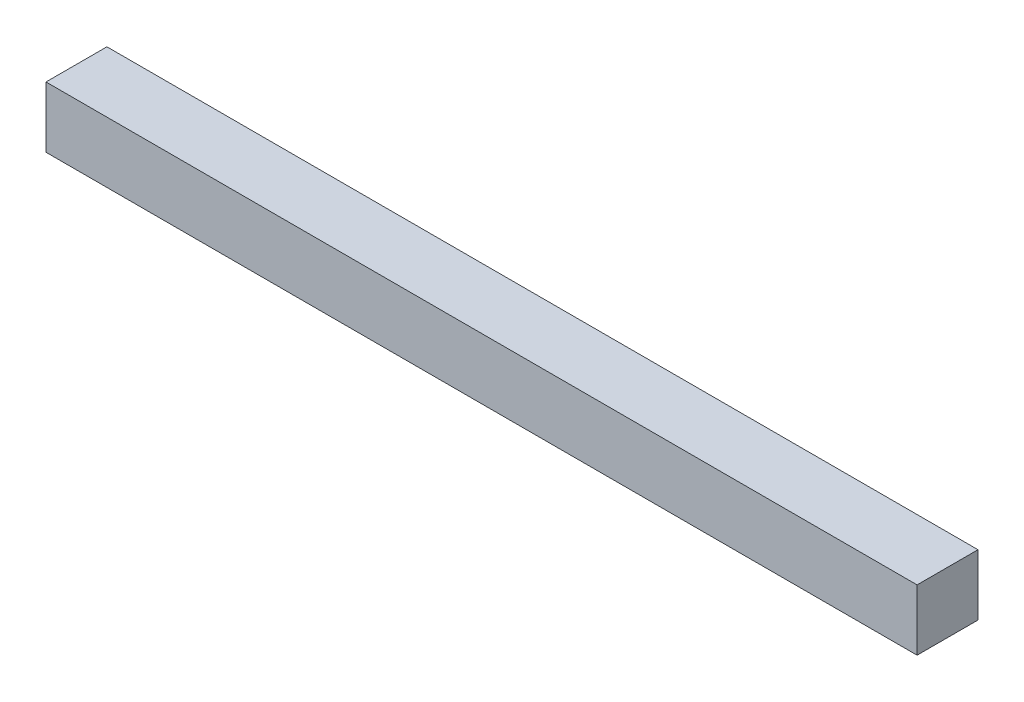
ISO-10303-21;
HEADER;
FILE_DESCRIPTION(('STEP AP214'),'2;1');
FILE_NAME('part.step','',(''),(''),'','','');
FILE_SCHEMA(('AUTOMOTIVE_DESIGN { 1 0 10303 214 1 1 1 1 }'));
ENDSEC;
DATA;
#1=APPLICATION_CONTEXT('core data for automotive mechanical design processes');
#2=APPLICATION_PROTOCOL_DEFINITION('international standard','automotive_design',2000,#1);
#3=PRODUCT_CONTEXT('',#1,'mechanical');
#4=PRODUCT('Part','Part','',(#3));
#5=PRODUCT_RELATED_PRODUCT_CATEGORY('part','',(#4));
#6=PRODUCT_DEFINITION_FORMATION('','',#4);
#7=PRODUCT_DEFINITION_CONTEXT('part definition',#1,'design');
#8=PRODUCT_DEFINITION('design','',#6,#7);
#9=PRODUCT_DEFINITION_SHAPE('','',#8);
#10=(LENGTH_UNIT() NAMED_UNIT(*) SI_UNIT(.MILLI.,.METRE.));
#11=(NAMED_UNIT(*) PLANE_ANGLE_UNIT() SI_UNIT($,.RADIAN.));
#12=(NAMED_UNIT(*) SI_UNIT($,.STERADIAN.) SOLID_ANGLE_UNIT());
#13=UNCERTAINTY_MEASURE_WITH_UNIT(LENGTH_MEASURE(1.E-05),#10,'distance_accuracy_value','');
#14=(GEOMETRIC_REPRESENTATION_CONTEXT(3) GLOBAL_UNCERTAINTY_ASSIGNED_CONTEXT((#13)) GLOBAL_UNIT_ASSIGNED_CONTEXT((#10,
#11,#12)) REPRESENTATION_CONTEXT('',''));
#15=CARTESIAN_POINT('',(0.,0.,0.));
#16=DIRECTION('',(0.,0.,1.));
#17=DIRECTION('',(1.,0.,0.));
#18=AXIS2_PLACEMENT_3D('',#15,#16,#17);
#19=CARTESIAN_POINT('',(-5.38325226573543,3.19905213270142,10.));
#20=DIRECTION('',(1.,0.,0.));
#21=DIRECTION('',(0.,1.,0.));
#22=AXIS2_PLACEMENT_3D('',#19,#20,#21);
#23=PLANE('',#22);
#24=DIRECTION('',(0.,-1.,0.));
#25=VECTOR('',#24,1.);
#26=CARTESIAN_POINT('',(-5.38325226573543,3.19905213270142,0.));
#27=LINE('',#26,#25);
#28=CARTESIAN_POINT('',(-5.38325226573543,3.19905213270142,0.));
#29=VERTEX_POINT('',#28);
#30=CARTESIAN_POINT('',(-5.38325226573543,-6.80094786729858,0.));
#31=VERTEX_POINT('',#30);
#32=EDGE_CURVE('E96',#29,#31,#27,.T.);
#33=ORIENTED_EDGE('',*,*,#32,.T.);
#34=DIRECTION('',(0.,0.,-1.));
#35=VECTOR('',#34,1.);
#36=CARTESIAN_POINT('',(-5.38325226573543,-6.80094786729858,10.));
#37=LINE('',#36,#35);
#38=CARTESIAN_POINT('',(-5.38325226573543,-6.80094786729858,10.));
#39=VERTEX_POINT('',#38);
#40=EDGE_CURVE('E11',#39,#31,#37,.T.);
#41=ORIENTED_EDGE('',*,*,#40,.F.);
#42=DIRECTION('',(0.,-1.,0.));
#43=VECTOR('',#42,1.);
#44=CARTESIAN_POINT('',(-5.38325226573543,3.19905213270142,10.));
#45=LINE('',#44,#43);
#46=CARTESIAN_POINT('',(-5.38325226573543,3.19905213270142,10.));
#47=VERTEX_POINT('',#46);
#48=EDGE_CURVE('E82',#47,#39,#45,.T.);
#49=ORIENTED_EDGE('',*,*,#48,.F.);
#50=DIRECTION('',(0.,0.,-1.));
#51=VECTOR('',#50,1.);
#52=CARTESIAN_POINT('',(-5.38325226573543,3.19905213270142,10.));
#53=LINE('',#52,#51);
#54=EDGE_CURVE('E49',#47,#29,#53,.T.);
#55=ORIENTED_EDGE('',*,*,#54,.T.);
#56=EDGE_LOOP('',(#33,#41,#49,#55));
#57=FACE_BOUND('',#56,.T.);
#58=ADVANCED_FACE('F33',(#57),#23,.F.);
#59=CARTESIAN_POINT('',(-5.38325226573543,-6.80094786729858,10.));
#60=DIRECTION('',(0.,1.,0.));
#61=DIRECTION('',(0.,0.,1.));
#62=AXIS2_PLACEMENT_3D('',#59,#60,#61);
#63=PLANE('',#62);
#64=DIRECTION('',(1.,0.,0.));
#65=VECTOR('',#64,1.);
#66=CARTESIAN_POINT('',(-5.38325226573543,-6.80094786729858,0.));
#67=LINE('',#66,#65);
#68=CARTESIAN_POINT('',(137.616747734265,-6.80094786729858,0.));
#69=VERTEX_POINT('',#68);
#70=EDGE_CURVE('E87',#31,#69,#67,.T.);
#71=ORIENTED_EDGE('',*,*,#70,.T.);
#72=DIRECTION('',(0.,0.,-1.));
#73=VECTOR('',#72,1.);
#74=CARTESIAN_POINT('',(137.616747734265,-6.80094786729858,10.));
#75=LINE('',#74,#73);
#76=CARTESIAN_POINT('',(137.616747734265,-6.80094786729858,10.));
#77=VERTEX_POINT('',#76);
#78=EDGE_CURVE('E41',#77,#69,#75,.T.);
#79=ORIENTED_EDGE('',*,*,#78,.F.);
#80=DIRECTION('',(1.,0.,0.));
#81=VECTOR('',#80,1.);
#82=CARTESIAN_POINT('',(-5.38325226573543,-6.80094786729858,10.));
#83=LINE('',#82,#81);
#84=EDGE_CURVE('E74',#39,#77,#83,.T.);
#85=ORIENTED_EDGE('',*,*,#84,.F.);
#86=ORIENTED_EDGE('',*,*,#40,.T.);
#87=EDGE_LOOP('',(#71,#79,#85,#86));
#88=FACE_BOUND('',#87,.T.);
#89=ADVANCED_FACE('F86',(#88),#63,.F.);
#90=CARTESIAN_POINT('',(137.616747734265,3.19905213270142,10.));
#91=DIRECTION('',(1.,0.,0.));
#92=DIRECTION('',(0.,0.,-1.));
#93=AXIS2_PLACEMENT_3D('',#90,#91,#92);
#94=PLANE('',#93);
#95=DIRECTION('',(0.,-1.,0.));
#96=VECTOR('',#95,1.);
#97=CARTESIAN_POINT('',(137.616747734265,3.19905213270142,0.));
#98=LINE('',#97,#96);
#99=CARTESIAN_POINT('',(137.616747734265,3.19905213270142,0.));
#100=VERTEX_POINT('',#99);
#101=EDGE_CURVE('E99',#100,#69,#98,.T.);
#102=ORIENTED_EDGE('',*,*,#101,.F.);
#103=DIRECTION('',(0.,0.,-1.));
#104=VECTOR('',#103,1.);
#105=CARTESIAN_POINT('',(137.616747734265,3.19905213270142,10.));
#106=LINE('',#105,#104);
#107=CARTESIAN_POINT('',(137.616747734265,3.19905213270142,10.));
#108=VERTEX_POINT('',#107);
#109=EDGE_CURVE('E63',#108,#100,#106,.T.);
#110=ORIENTED_EDGE('',*,*,#109,.F.);
#111=DIRECTION('',(0.,-1.,0.));
#112=VECTOR('',#111,1.);
#113=CARTESIAN_POINT('',(137.616747734265,3.19905213270142,10.));
#114=LINE('',#113,#112);
#115=EDGE_CURVE('E81',#108,#77,#114,.T.);
#116=ORIENTED_EDGE('',*,*,#115,.T.);
#117=ORIENTED_EDGE('',*,*,#78,.T.);
#118=EDGE_LOOP('',(#102,#110,#116,#117));
#119=FACE_BOUND('',#118,.T.);
#120=ADVANCED_FACE('F90',(#119),#94,.T.);
#121=CARTESIAN_POINT('',(-5.38325226573543,3.19905213270142,10.));
#122=DIRECTION('',(0.,1.,0.));
#123=DIRECTION('',(0.,0.,1.));
#124=AXIS2_PLACEMENT_3D('',#121,#122,#123);
#125=PLANE('',#124);
#126=DIRECTION('',(1.,0.,0.));
#127=VECTOR('',#126,1.);
#128=CARTESIAN_POINT('',(-5.38325226573543,3.19905213270142,0.));
#129=LINE('',#128,#127);
#130=EDGE_CURVE('E101',#29,#100,#129,.T.);
#131=ORIENTED_EDGE('',*,*,#130,.F.);
#132=ORIENTED_EDGE('',*,*,#54,.F.);
#133=DIRECTION('',(1.,0.,0.));
#134=VECTOR('',#133,1.);
#135=CARTESIAN_POINT('',(-5.38325226573543,3.19905213270142,10.));
#136=LINE('',#135,#134);
#137=EDGE_CURVE('E91',#47,#108,#136,.T.);
#138=ORIENTED_EDGE('',*,*,#137,.T.);
#139=ORIENTED_EDGE('',*,*,#109,.T.);
#140=EDGE_LOOP('',(#131,#132,#138,#139));
#141=FACE_BOUND('',#140,.T.);
#142=ADVANCED_FACE('F107',(#141),#125,.T.);
#143=CARTESIAN_POINT('',(0.,0.,10.));
#144=DIRECTION('',(0.,0.,1.));
#145=DIRECTION('',(1.,0.,0.));
#146=AXIS2_PLACEMENT_3D('',#143,#144,#145);
#147=PLANE('',#146);
#148=ORIENTED_EDGE('',*,*,#48,.T.);
#149=ORIENTED_EDGE('',*,*,#84,.T.);
#150=ORIENTED_EDGE('',*,*,#115,.F.);
#151=ORIENTED_EDGE('',*,*,#137,.F.);
#152=EDGE_LOOP('',(#148,#149,#150,#151));
#153=FACE_BOUND('',#152,.T.);
#154=ADVANCED_FACE('F78',(#153),#147,.T.);
#155=CARTESIAN_POINT('',(0.,0.,0.));
#156=DIRECTION('',(0.,0.,1.));
#157=DIRECTION('',(1.,0.,0.));
#158=AXIS2_PLACEMENT_3D('',#155,#156,#157);
#159=PLANE('',#158);
#160=ORIENTED_EDGE('',*,*,#32,.F.);
#161=ORIENTED_EDGE('',*,*,#130,.T.);
#162=ORIENTED_EDGE('',*,*,#101,.T.);
#163=ORIENTED_EDGE('',*,*,#70,.F.);
#164=EDGE_LOOP('',(#160,#161,#162,#163));
#165=FACE_BOUND('',#164,.T.);
#166=ADVANCED_FACE('F106',(#165),#159,.F.);
#167=CLOSED_SHELL('',(#58,#89,#120,#142,#154,#166));
#168=MANIFOLD_SOLID_BREP('B2',#167);
#169=ADVANCED_BREP_SHAPE_REPRESENTATION('',(#18,#168),#14);
#170=SHAPE_DEFINITION_REPRESENTATION(#9,#169);
ENDSEC;
END-ISO-10303-21;
